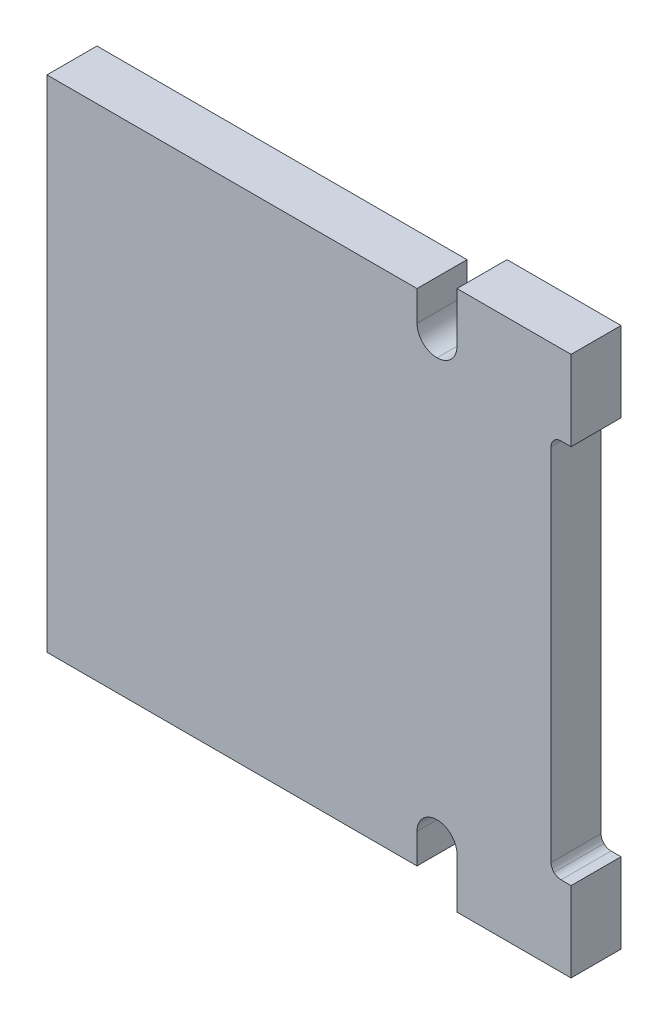
ISO-10303-21;
HEADER;
FILE_DESCRIPTION(('STEP AP214'),'2;1');
FILE_NAME('part.step','',(''),(''),'','','');
FILE_SCHEMA(('AUTOMOTIVE_DESIGN { 1 0 10303 214 1 1 1 1 }'));
ENDSEC;
DATA;
#1=APPLICATION_CONTEXT('core data for automotive mechanical design processes');
#2=APPLICATION_PROTOCOL_DEFINITION('international standard','automotive_design',2000,#1);
#3=PRODUCT_CONTEXT('',#1,'mechanical');
#4=PRODUCT('Part','Part','',(#3));
#5=PRODUCT_RELATED_PRODUCT_CATEGORY('part','',(#4));
#6=PRODUCT_DEFINITION_FORMATION('','',#4);
#7=PRODUCT_DEFINITION_CONTEXT('part definition',#1,'design');
#8=PRODUCT_DEFINITION('design','',#6,#7);
#9=PRODUCT_DEFINITION_SHAPE('','',#8);
#10=(LENGTH_UNIT() NAMED_UNIT(*) SI_UNIT(.MILLI.,.METRE.));
#11=(NAMED_UNIT(*) PLANE_ANGLE_UNIT() SI_UNIT($,.RADIAN.));
#12=(NAMED_UNIT(*) SI_UNIT($,.STERADIAN.) SOLID_ANGLE_UNIT());
#13=UNCERTAINTY_MEASURE_WITH_UNIT(LENGTH_MEASURE(1.E-05),#10,'distance_accuracy_value','');
#14=(GEOMETRIC_REPRESENTATION_CONTEXT(3) GLOBAL_UNCERTAINTY_ASSIGNED_CONTEXT((#13)) GLOBAL_UNIT_ASSIGNED_CONTEXT((#10,
#11,#12)) REPRESENTATION_CONTEXT('',''));
#15=CARTESIAN_POINT('',(0.,0.,0.));
#16=DIRECTION('',(0.,0.,1.));
#17=DIRECTION('',(1.,0.,0.));
#18=AXIS2_PLACEMENT_3D('',#15,#16,#17);
#19=CARTESIAN_POINT('',(2.5335472746525,0.,0.5));
#20=DIRECTION('',(0.,0.,1.));
#21=DIRECTION('',(1.,0.,0.));
#22=AXIS2_PLACEMENT_3D('',#19,#20,#21);
#23=PLANE('',#22);
#24=DIRECTION('',(0.,1.,0.));
#25=VECTOR('',#24,1.);
#26=CARTESIAN_POINT('',(-0.249999999999971,2.5,0.5));
#27=LINE('',#26,#25);
#28=CARTESIAN_POINT('',(-0.249999999999972,-2.50000000000011,0.5));
#29=VERTEX_POINT('',#28);
#30=CARTESIAN_POINT('',(-0.249999999999971,2.5,0.5));
#31=VERTEX_POINT('',#30);
#32=EDGE_CURVE('E356',#29,#31,#27,.T.);
#33=ORIENTED_EDGE('',*,*,#32,.F.);
#34=DIRECTION('',(-1.,0.,0.));
#35=VECTOR('',#34,1.);
#36=CARTESIAN_POINT('',(-0.249999999999972,-2.50000000000011,0.5));
#37=LINE('',#36,#35);
#38=CARTESIAN_POINT('',(3.45,-2.50000000000011,0.5));
#39=VERTEX_POINT('',#38);
#40=EDGE_CURVE('E11',#39,#29,#37,.T.);
#41=ORIENTED_EDGE('',*,*,#40,.F.);
#42=DIRECTION('',(0.,-1.,0.));
#43=VECTOR('',#42,1.);
#44=CARTESIAN_POINT('',(3.45000000000005,2.49999999999994,0.5));
#45=LINE('',#44,#43);
#46=CARTESIAN_POINT('',(3.45,-2.20000000000005,0.5));
#47=VERTEX_POINT('',#46);
#48=EDGE_CURVE('E400',#47,#39,#45,.T.);
#49=ORIENTED_EDGE('',*,*,#48,.F.);
#50=CARTESIAN_POINT('',(3.65,-2.20000000000005,0.5));
#51=DIRECTION('',(0.,0.,1.));
#52=DIRECTION('',(0.,1.,0.));
#53=AXIS2_PLACEMENT_3D('',#50,#51,#52);
#54=CIRCLE('',#53,0.199999999999989);
#55=CARTESIAN_POINT('',(3.65,-2.00000000000006,0.5));
#56=VERTEX_POINT('',#55);
#57=EDGE_CURVE('E533',#56,#47,#54,.T.);
#58=ORIENTED_EDGE('',*,*,#57,.F.);
#59=CARTESIAN_POINT('',(3.65,-2.20000000000005,0.5));
#60=DIRECTION('',(0.,0.,1.));
#61=DIRECTION('',(0.,1.,0.));
#62=AXIS2_PLACEMENT_3D('',#59,#60,#61);
#63=CIRCLE('',#62,0.199999999999989);
#64=CARTESIAN_POINT('',(3.85,-2.20000000000004,0.5));
#65=VERTEX_POINT('',#64);
#66=EDGE_CURVE('E46',#65,#56,#63,.T.);
#67=ORIENTED_EDGE('',*,*,#66,.F.);
#68=DIRECTION('',(0.,1.,0.));
#69=VECTOR('',#68,1.);
#70=CARTESIAN_POINT('',(3.85,0.999999999999772,0.5));
#71=LINE('',#70,#69);
#72=CARTESIAN_POINT('',(3.85,-2.7,0.5));
#73=VERTEX_POINT('',#72);
#74=EDGE_CURVE('E425',#73,#65,#71,.T.);
#75=ORIENTED_EDGE('',*,*,#74,.F.);
#76=DIRECTION('',(-1.,0.,0.));
#77=VECTOR('',#76,1.);
#78=CARTESIAN_POINT('',(3.85,-2.7,0.5));
#79=LINE('',#78,#77);
#80=CARTESIAN_POINT('',(4.99,-2.69999999999993,0.5));
#81=VERTEX_POINT('',#80);
#82=EDGE_CURVE('E420',#81,#73,#79,.T.);
#83=ORIENTED_EDGE('',*,*,#82,.F.);
#84=DIRECTION('',(0.,-1.,0.));
#85=VECTOR('',#84,1.);
#86=CARTESIAN_POINT('',(4.99,2.70000000000004,0.5));
#87=LINE('',#86,#85);
#88=CARTESIAN_POINT('',(4.99,-1.90000000000004,0.5));
#89=VERTEX_POINT('',#88);
#90=EDGE_CURVE('E412',#89,#81,#87,.T.);
#91=ORIENTED_EDGE('',*,*,#90,.F.);
#92=DIRECTION('',(1.,-2.84400785257291E-13,0.));
#93=VECTOR('',#92,1.);
#94=CARTESIAN_POINT('',(4.99,-1.90000000000004,0.5));
#95=LINE('',#94,#93);
#96=CARTESIAN_POINT('',(4.89,-1.9,0.5));
#97=VERTEX_POINT('',#96);
#98=EDGE_CURVE('E404',#97,#89,#95,.T.);
#99=ORIENTED_EDGE('',*,*,#98,.F.);
#100=CARTESIAN_POINT('',(4.89,-1.8,0.5));
#101=DIRECTION('',(0.,0.,1.));
#102=DIRECTION('',(-0.707106781186449,-0.707106781186646,0.));
#103=AXIS2_PLACEMENT_3D('',#100,#101,#102);
#104=CIRCLE('',#103,0.100000000000009);
#105=CARTESIAN_POINT('',(4.81928932188135,-1.87071067811867,0.5));
#106=VERTEX_POINT('',#105);
#107=EDGE_CURVE('E513',#106,#97,#104,.T.);
#108=ORIENTED_EDGE('',*,*,#107,.F.);
#109=CARTESIAN_POINT('',(4.89,-1.8,0.5));
#110=DIRECTION('',(0.,0.,1.));
#111=DIRECTION('',(-0.707106781186449,-0.707106781186646,0.));
#112=AXIS2_PLACEMENT_3D('',#109,#110,#111);
#113=CIRCLE('',#112,0.100000000000009);
#114=CARTESIAN_POINT('',(4.79,-1.8,0.5));
#115=VERTEX_POINT('',#114);
#116=EDGE_CURVE('E258',#115,#106,#113,.T.);
#117=ORIENTED_EDGE('',*,*,#116,.F.);
#118=DIRECTION('',(0.,-1.,0.));
#119=VECTOR('',#118,1.);
#120=CARTESIAN_POINT('',(4.79,-1.8,0.5));
#121=LINE('',#120,#119);
#122=CARTESIAN_POINT('',(4.79,1.79999999999995,0.5));
#123=VERTEX_POINT('',#122);
#124=EDGE_CURVE('E255',#123,#115,#121,.T.);
#125=ORIENTED_EDGE('',*,*,#124,.F.);
#126=CARTESIAN_POINT('',(4.89,1.79999999999995,0.5));
#127=DIRECTION('',(0.,0.,1.));
#128=DIRECTION('',(-0.707106781186547,0.707106781186549,0.));
#129=AXIS2_PLACEMENT_3D('',#126,#127,#128);
#130=CIRCLE('',#129,0.0999999999999942);
#131=CARTESIAN_POINT('',(4.81928932188135,1.8707106781186,0.5));
#132=VERTEX_POINT('',#131);
#133=EDGE_CURVE('E560',#132,#123,#130,.T.);
#134=ORIENTED_EDGE('',*,*,#133,.F.);
#135=CARTESIAN_POINT('',(4.89,1.79999999999995,0.5));
#136=DIRECTION('',(0.,0.,1.));
#137=DIRECTION('',(-0.707106781186547,0.707106781186549,0.));
#138=AXIS2_PLACEMENT_3D('',#135,#136,#137);
#139=CIRCLE('',#138,0.0999999999999942);
#140=CARTESIAN_POINT('',(4.89,1.89999999999995,0.5));
#141=VERTEX_POINT('',#140);
#142=EDGE_CURVE('E395',#141,#132,#139,.T.);
#143=ORIENTED_EDGE('',*,*,#142,.F.);
#144=DIRECTION('',(-1.,-2.84033403351144E-13,0.));
#145=VECTOR('',#144,1.);
#146=CARTESIAN_POINT('',(4.89,1.89999999999995,0.5));
#147=LINE('',#146,#145);
#148=CARTESIAN_POINT('',(4.99,1.9,0.5));
#149=VERTEX_POINT('',#148);
#150=EDGE_CURVE('E376',#149,#141,#147,.T.);
#151=ORIENTED_EDGE('',*,*,#150,.F.);
#152=DIRECTION('',(0.,-1.,0.));
#153=VECTOR('',#152,1.);
#154=CARTESIAN_POINT('',(4.99,1.9,0.5));
#155=LINE('',#154,#153);
#156=CARTESIAN_POINT('',(4.99,2.70000000000004,0.5));
#157=VERTEX_POINT('',#156);
#158=EDGE_CURVE('E388',#157,#149,#155,.T.);
#159=ORIENTED_EDGE('',*,*,#158,.F.);
#160=DIRECTION('',(1.,0.,0.));
#161=VECTOR('',#160,1.);
#162=CARTESIAN_POINT('',(4.99,2.70000000000004,0.5));
#163=LINE('',#162,#161);
#164=CARTESIAN_POINT('',(3.85000000000005,2.70000000000004,0.5));
#165=VERTEX_POINT('',#164);
#166=EDGE_CURVE('E347',#165,#157,#163,.T.);
#167=ORIENTED_EDGE('',*,*,#166,.F.);
#168=DIRECTION('',(0.,1.,0.));
#169=VECTOR('',#168,1.);
#170=CARTESIAN_POINT('',(3.85,0.999999999999772,0.5));
#171=LINE('',#170,#169);
#172=CARTESIAN_POINT('',(3.85,2.19999999999986,0.5));
#173=VERTEX_POINT('',#172);
#174=EDGE_CURVE('E329',#173,#165,#171,.T.);
#175=ORIENTED_EDGE('',*,*,#174,.F.);
#176=CARTESIAN_POINT('',(3.65,2.19999999999987,0.5));
#177=DIRECTION('',(0.,0.,1.));
#178=DIRECTION('',(0.,-1.,0.));
#179=AXIS2_PLACEMENT_3D('',#176,#177,#178);
#180=CIRCLE('',#179,0.200000000000003);
#181=CARTESIAN_POINT('',(3.65,1.99999999999987,0.5));
#182=VERTEX_POINT('',#181);
#183=EDGE_CURVE('E466',#182,#173,#180,.T.);
#184=ORIENTED_EDGE('',*,*,#183,.F.);
#185=CARTESIAN_POINT('',(3.65,2.19999999999987,0.5));
#186=DIRECTION('',(0.,0.,1.));
#187=DIRECTION('',(0.,-1.,0.));
#188=AXIS2_PLACEMENT_3D('',#185,#186,#187);
#189=CIRCLE('',#188,0.200000000000003);
#190=CARTESIAN_POINT('',(3.45,2.19999999999987,0.5));
#191=VERTEX_POINT('',#190);
#192=EDGE_CURVE('E334',#191,#182,#189,.T.);
#193=ORIENTED_EDGE('',*,*,#192,.F.);
#194=DIRECTION('',(0.,-1.,0.));
#195=VECTOR('',#194,1.);
#196=CARTESIAN_POINT('',(3.45,2.19999999999987,0.5));
#197=LINE('',#196,#195);
#198=CARTESIAN_POINT('',(3.45000000000005,2.49999999999994,0.5));
#199=VERTEX_POINT('',#198);
#200=EDGE_CURVE('E369',#199,#191,#197,.T.);
#201=ORIENTED_EDGE('',*,*,#200,.F.);
#202=DIRECTION('',(1.,0.,0.));
#203=VECTOR('',#202,1.);
#204=CARTESIAN_POINT('',(3.45000000000005,2.49999999999994,0.5));
#205=LINE('',#204,#203);
#206=EDGE_CURVE('E361',#31,#199,#205,.T.);
#207=ORIENTED_EDGE('',*,*,#206,.F.);
#208=EDGE_LOOP('',(#33,#41,#49,#58,#67,#75,#83,#91,#99,#108,#117,#125,#134,#143,#151,#159,#167,
#175,#184,#193,#201,#207));
#209=FACE_BOUND('',#208,.T.);
#210=ADVANCED_FACE('F17',(#209),#23,.T.);
#211=CARTESIAN_POINT('',(3.45,-2.50000000000011,0.));
#212=DIRECTION('',(0.,-1.,0.));
#213=DIRECTION('',(-1.,0.,0.));
#214=AXIS2_PLACEMENT_3D('',#211,#212,#213);
#215=PLANE('',#214);
#216=ORIENTED_EDGE('',*,*,#40,.T.);
#217=DIRECTION('',(0.,0.,1.));
#218=VECTOR('',#217,1.);
#219=CARTESIAN_POINT('',(-0.249999999999972,-2.50000000000011,0.));
#220=LINE('',#219,#218);
#221=CARTESIAN_POINT('',(-0.249999999999972,-2.50000000000011,0.));
#222=VERTEX_POINT('',#221);
#223=EDGE_CURVE('E352',#222,#29,#220,.T.);
#224=ORIENTED_EDGE('',*,*,#223,.F.);
#225=DIRECTION('',(1.,0.,0.));
#226=VECTOR('',#225,1.);
#227=CARTESIAN_POINT('',(-0.249999999999972,-2.50000000000011,0.));
#228=LINE('',#227,#226);
#229=CARTESIAN_POINT('',(3.45,-2.50000000000011,0.));
#230=VERTEX_POINT('',#229);
#231=EDGE_CURVE('E312',#222,#230,#228,.T.);
#232=ORIENTED_EDGE('',*,*,#231,.T.);
#233=DIRECTION('',(0.,0.,1.));
#234=VECTOR('',#233,1.);
#235=CARTESIAN_POINT('',(3.44999999999958,-2.50000000000011,0.));
#236=LINE('',#235,#234);
#237=EDGE_CURVE('E25',#230,#39,#236,.T.);
#238=ORIENTED_EDGE('',*,*,#237,.T.);
#239=EDGE_LOOP('',(#216,#224,#232,#238));
#240=FACE_BOUND('',#239,.T.);
#241=ADVANCED_FACE('F611',(#240),#215,.T.);
#242=CARTESIAN_POINT('',(3.45000000000005,2.49999999999994,0.));
#243=DIRECTION('',(1.,0.,0.));
#244=DIRECTION('',(0.,-1.,0.));
#245=AXIS2_PLACEMENT_3D('',#242,#243,#244);
#246=PLANE('',#245);
#247=ORIENTED_EDGE('',*,*,#48,.T.);
#248=ORIENTED_EDGE('',*,*,#237,.F.);
#249=DIRECTION('',(0.,1.,0.));
#250=VECTOR('',#249,1.);
#251=CARTESIAN_POINT('',(3.45000000000005,2.49999999999994,0.));
#252=LINE('',#251,#250);
#253=CARTESIAN_POINT('',(3.45,-2.20000000000005,0.));
#254=VERTEX_POINT('',#253);
#255=EDGE_CURVE('E306',#230,#254,#252,.T.);
#256=ORIENTED_EDGE('',*,*,#255,.T.);
#257=DIRECTION('',(0.,0.,1.));
#258=VECTOR('',#257,1.);
#259=CARTESIAN_POINT('',(3.44999999999981,-2.20000000000003,0.));
#260=LINE('',#259,#258);
#261=EDGE_CURVE('E526',#254,#47,#260,.T.);
#262=ORIENTED_EDGE('',*,*,#261,.T.);
#263=EDGE_LOOP('',(#247,#248,#256,#262));
#264=FACE_BOUND('',#263,.T.);
#265=ADVANCED_FACE('F540',(#264),#246,.T.);
#266=CARTESIAN_POINT('',(3.65,-2.20000000000005,0.));
#267=DIRECTION('',(0.,0.,1.));
#268=DIRECTION('',(0.,1.,0.));
#269=AXIS2_PLACEMENT_3D('',#266,#267,#268);
#270=CYLINDRICAL_SURFACE('',#269,0.199999999999989);
#271=DIRECTION('',(0.,0.,1.));
#272=VECTOR('',#271,1.);
#273=CARTESIAN_POINT('',(3.65,-2.00000000000006,0.));
#274=LINE('',#273,#272);
#275=CARTESIAN_POINT('',(3.65,-2.00000000000006,0.));
#276=VERTEX_POINT('',#275);
#277=EDGE_CURVE('E552',#276,#56,#274,.T.);
#278=ORIENTED_EDGE('',*,*,#277,.F.);
#279=CARTESIAN_POINT('',(3.65,-2.20000000000005,0.));
#280=DIRECTION('',(0.,0.,-1.));
#281=DIRECTION('',(0.,1.,0.));
#282=AXIS2_PLACEMENT_3D('',#279,#280,#281);
#283=CIRCLE('',#282,0.199999999999989);
#284=CARTESIAN_POINT('',(3.85,-2.20000000000004,0.));
#285=VERTEX_POINT('',#284);
#286=EDGE_CURVE('E301',#276,#285,#283,.T.);
#287=ORIENTED_EDGE('',*,*,#286,.T.);
#288=DIRECTION('',(0.,0.,1.));
#289=VECTOR('',#288,1.);
#290=CARTESIAN_POINT('',(3.85,-2.20000000000005,0.));
#291=LINE('',#290,#289);
#292=EDGE_CURVE('E401',#285,#65,#291,.T.);
#293=ORIENTED_EDGE('',*,*,#292,.T.);
#294=ORIENTED_EDGE('',*,*,#66,.T.);
#295=EDGE_LOOP('',(#278,#287,#293,#294));
#296=FACE_BOUND('',#295,.T.);
#297=ADVANCED_FACE('F996',(#296),#270,.F.);
#298=CARTESIAN_POINT('',(3.85,0.999999999999772,0.));
#299=DIRECTION('',(1.,0.,0.));
#300=DIRECTION('',(0.,-1.,0.));
#301=AXIS2_PLACEMENT_3D('',#298,#299,#300);
#302=PLANE('',#301);
#303=ORIENTED_EDGE('',*,*,#74,.T.);
#304=ORIENTED_EDGE('',*,*,#292,.F.);
#305=DIRECTION('',(0.,-1.,0.));
#306=VECTOR('',#305,1.);
#307=CARTESIAN_POINT('',(3.85,0.999999999999772,0.));
#308=LINE('',#307,#306);
#309=CARTESIAN_POINT('',(3.85,-2.7,0.));
#310=VERTEX_POINT('',#309);
#311=EDGE_CURVE('E297',#285,#310,#308,.T.);
#312=ORIENTED_EDGE('',*,*,#311,.T.);
#313=DIRECTION('',(0.,0.,1.));
#314=VECTOR('',#313,1.);
#315=CARTESIAN_POINT('',(3.85,-2.7,0.));
#316=LINE('',#315,#314);
#317=EDGE_CURVE('E421',#310,#73,#316,.T.);
#318=ORIENTED_EDGE('',*,*,#317,.T.);
#319=EDGE_LOOP('',(#303,#304,#312,#318));
#320=FACE_BOUND('',#319,.T.);
#321=ADVANCED_FACE('F994',(#320),#302,.F.);
#322=CARTESIAN_POINT('',(4.99,-2.69999999999993,0.));
#323=DIRECTION('',(0.,-1.,0.));
#324=DIRECTION('',(0.,0.,-1.));
#325=AXIS2_PLACEMENT_3D('',#322,#323,#324);
#326=PLANE('',#325);
#327=ORIENTED_EDGE('',*,*,#82,.T.);
#328=ORIENTED_EDGE('',*,*,#317,.F.);
#329=DIRECTION('',(1.,0.,0.));
#330=VECTOR('',#329,1.);
#331=CARTESIAN_POINT('',(3.85,-2.7,0.));
#332=LINE('',#331,#330);
#333=CARTESIAN_POINT('',(4.99,-2.69999999999993,0.));
#334=VERTEX_POINT('',#333);
#335=EDGE_CURVE('E302',#310,#334,#332,.T.);
#336=ORIENTED_EDGE('',*,*,#335,.T.);
#337=DIRECTION('',(0.,0.,1.));
#338=VECTOR('',#337,1.);
#339=CARTESIAN_POINT('',(4.99,-2.69999999999993,0.));
#340=LINE('',#339,#338);
#341=EDGE_CURVE('E416',#334,#81,#340,.T.);
#342=ORIENTED_EDGE('',*,*,#341,.T.);
#343=EDGE_LOOP('',(#327,#328,#336,#342));
#344=FACE_BOUND('',#343,.T.);
#345=ADVANCED_FACE('F989',(#344),#326,.T.);
#346=CARTESIAN_POINT('',(4.99,2.70000000000004,0.));
#347=DIRECTION('',(1.,0.,0.));
#348=DIRECTION('',(0.,-1.,0.));
#349=AXIS2_PLACEMENT_3D('',#346,#347,#348);
#350=PLANE('',#349);
#351=ORIENTED_EDGE('',*,*,#90,.T.);
#352=ORIENTED_EDGE('',*,*,#341,.F.);
#353=DIRECTION('',(0.,1.,0.));
#354=VECTOR('',#353,1.);
#355=CARTESIAN_POINT('',(4.99,2.70000000000004,0.));
#356=LINE('',#355,#354);
#357=CARTESIAN_POINT('',(4.99,-1.90000000000004,0.));
#358=VERTEX_POINT('',#357);
#359=EDGE_CURVE('E290',#334,#358,#356,.T.);
#360=ORIENTED_EDGE('',*,*,#359,.T.);
#361=DIRECTION('',(0.,0.,1.));
#362=VECTOR('',#361,1.);
#363=CARTESIAN_POINT('',(4.99,-1.90000000000004,0.));
#364=LINE('',#363,#362);
#365=EDGE_CURVE('E408',#358,#89,#364,.T.);
#366=ORIENTED_EDGE('',*,*,#365,.T.);
#367=EDGE_LOOP('',(#351,#352,#360,#366));
#368=FACE_BOUND('',#367,.T.);
#369=ADVANCED_FACE('F992',(#368),#350,.T.);
#370=CARTESIAN_POINT('',(4.89,-1.9,0.));
#371=DIRECTION('',(2.84400785257291E-13,1.,0.));
#372=DIRECTION('',(1.,-2.84400785257291E-13,0.));
#373=AXIS2_PLACEMENT_3D('',#370,#371,#372);
#374=PLANE('',#373);
#375=ORIENTED_EDGE('',*,*,#98,.T.);
#376=ORIENTED_EDGE('',*,*,#365,.F.);
#377=DIRECTION('',(-1.,2.84400785257291E-13,0.));
#378=VECTOR('',#377,1.);
#379=CARTESIAN_POINT('',(4.99,-1.90000000000004,0.));
#380=LINE('',#379,#378);
#381=CARTESIAN_POINT('',(4.89,-1.9,0.));
#382=VERTEX_POINT('',#381);
#383=EDGE_CURVE('E269',#358,#382,#380,.T.);
#384=ORIENTED_EDGE('',*,*,#383,.T.);
#385=DIRECTION('',(0.,0.,1.));
#386=VECTOR('',#385,1.);
#387=CARTESIAN_POINT('',(4.89,-1.9,0.));
#388=LINE('',#387,#386);
#389=EDGE_CURVE('E451',#382,#97,#388,.T.);
#390=ORIENTED_EDGE('',*,*,#389,.T.);
#391=EDGE_LOOP('',(#375,#376,#384,#390));
#392=FACE_BOUND('',#391,.T.);
#393=ADVANCED_FACE('F1054',(#392),#374,.T.);
#394=CARTESIAN_POINT('',(4.89,-1.8,0.));
#395=DIRECTION('',(0.,0.,1.));
#396=DIRECTION('',(-0.707106781186449,-0.707106781186646,0.));
#397=AXIS2_PLACEMENT_3D('',#394,#395,#396);
#398=CYLINDRICAL_SURFACE('',#397,0.100000000000009);
#399=DIRECTION('',(0.,0.,1.));
#400=VECTOR('',#399,1.);
#401=CARTESIAN_POINT('',(4.81928932188135,-1.87071067811867,0.));
#402=LINE('',#401,#400);
#403=CARTESIAN_POINT('',(4.81928932188135,-1.87071067811867,0.));
#404=VERTEX_POINT('',#403);
#405=EDGE_CURVE('E264',#404,#106,#402,.T.);
#406=ORIENTED_EDGE('',*,*,#405,.F.);
#407=CARTESIAN_POINT('',(4.89,-1.8,0.));
#408=DIRECTION('',(0.,0.,-1.));
#409=DIRECTION('',(-0.707106781186449,-0.707106781186646,0.));
#410=AXIS2_PLACEMENT_3D('',#407,#408,#409);
#411=CIRCLE('',#410,0.100000000000009);
#412=CARTESIAN_POINT('',(4.79,-1.8,0.));
#413=VERTEX_POINT('',#412);
#414=EDGE_CURVE('E261',#404,#413,#411,.T.);
#415=ORIENTED_EDGE('',*,*,#414,.T.);
#416=DIRECTION('',(0.,0.,1.));
#417=VECTOR('',#416,1.);
#418=CARTESIAN_POINT('',(4.79,-1.8,0.));
#419=LINE('',#418,#417);
#420=EDGE_CURVE('E248',#413,#115,#419,.T.);
#421=ORIENTED_EDGE('',*,*,#420,.T.);
#422=ORIENTED_EDGE('',*,*,#116,.T.);
#423=EDGE_LOOP('',(#406,#415,#421,#422));
#424=FACE_BOUND('',#423,.T.);
#425=ADVANCED_FACE('F262',(#424),#398,.F.);
#426=CARTESIAN_POINT('',(4.79,1.79999999999995,0.));
#427=DIRECTION('',(1.,0.,0.));
#428=DIRECTION('',(0.,-1.,0.));
#429=AXIS2_PLACEMENT_3D('',#426,#427,#428);
#430=PLANE('',#429);
#431=ORIENTED_EDGE('',*,*,#124,.T.);
#432=ORIENTED_EDGE('',*,*,#420,.F.);
#433=DIRECTION('',(0.,1.,0.));
#434=VECTOR('',#433,1.);
#435=CARTESIAN_POINT('',(4.79,-1.8,0.));
#436=LINE('',#435,#434);
#437=CARTESIAN_POINT('',(4.79,1.79999999999995,0.));
#438=VERTEX_POINT('',#437);
#439=EDGE_CURVE('E253',#413,#438,#436,.T.);
#440=ORIENTED_EDGE('',*,*,#439,.T.);
#441=DIRECTION('',(0.,0.,1.));
#442=VECTOR('',#441,1.);
#443=CARTESIAN_POINT('',(4.79,1.79999999999995,0.));
#444=LINE('',#443,#442);
#445=EDGE_CURVE('E459',#438,#123,#444,.T.);
#446=ORIENTED_EDGE('',*,*,#445,.T.);
#447=EDGE_LOOP('',(#431,#432,#440,#446));
#448=FACE_BOUND('',#447,.T.);
#449=ADVANCED_FACE('F250',(#448),#430,.T.);
#450=CARTESIAN_POINT('',(4.89,1.79999999999995,0.));
#451=DIRECTION('',(0.,0.,1.));
#452=DIRECTION('',(-0.707106781186547,0.707106781186549,0.));
#453=AXIS2_PLACEMENT_3D('',#450,#451,#452);
#454=CYLINDRICAL_SURFACE('',#453,0.0999999999999942);
#455=DIRECTION('',(0.,0.,1.));
#456=VECTOR('',#455,1.);
#457=CARTESIAN_POINT('',(4.81928932188135,1.8707106781186,0.));
#458=LINE('',#457,#456);
#459=CARTESIAN_POINT('',(4.81928932188135,1.8707106781186,0.));
#460=VERTEX_POINT('',#459);
#461=EDGE_CURVE('E444',#460,#132,#458,.T.);
#462=ORIENTED_EDGE('',*,*,#461,.F.);
#463=CARTESIAN_POINT('',(4.89,1.79999999999995,0.));
#464=DIRECTION('',(0.,0.,-1.));
#465=DIRECTION('',(-0.707106781186547,0.707106781186549,0.));
#466=AXIS2_PLACEMENT_3D('',#463,#464,#465);
#467=CIRCLE('',#466,0.0999999999999942);
#468=CARTESIAN_POINT('',(4.89,1.89999999999995,0.));
#469=VERTEX_POINT('',#468);
#470=EDGE_CURVE('E277',#460,#469,#467,.T.);
#471=ORIENTED_EDGE('',*,*,#470,.T.);
#472=DIRECTION('',(0.,0.,1.));
#473=VECTOR('',#472,1.);
#474=CARTESIAN_POINT('',(4.89,1.89999999999995,0.));
#475=LINE('',#474,#473);
#476=EDGE_CURVE('E380',#469,#141,#475,.T.);
#477=ORIENTED_EDGE('',*,*,#476,.T.);
#478=ORIENTED_EDGE('',*,*,#142,.T.);
#479=EDGE_LOOP('',(#462,#471,#477,#478));
#480=FACE_BOUND('',#479,.T.);
#481=ADVANCED_FACE('F580',(#480),#454,.F.);
#482=CARTESIAN_POINT('',(4.99,1.9,0.));
#483=DIRECTION('',(2.84033403351144E-13,-1.,0.));
#484=DIRECTION('',(0.,0.,-1.));
#485=AXIS2_PLACEMENT_3D('',#482,#483,#484);
#486=PLANE('',#485);
#487=ORIENTED_EDGE('',*,*,#150,.T.);
#488=ORIENTED_EDGE('',*,*,#476,.F.);
#489=DIRECTION('',(1.,2.84033403351144E-13,0.));
#490=VECTOR('',#489,1.);
#491=CARTESIAN_POINT('',(4.89,1.89999999999995,0.));
#492=LINE('',#491,#490);
#493=CARTESIAN_POINT('',(4.99,1.9,0.));
#494=VERTEX_POINT('',#493);
#495=EDGE_CURVE('E284',#469,#494,#492,.T.);
#496=ORIENTED_EDGE('',*,*,#495,.T.);
#497=DIRECTION('',(0.,0.,1.));
#498=VECTOR('',#497,1.);
#499=CARTESIAN_POINT('',(4.99,1.9,0.));
#500=LINE('',#499,#498);
#501=EDGE_CURVE('E381',#494,#149,#500,.T.);
#502=ORIENTED_EDGE('',*,*,#501,.T.);
#503=EDGE_LOOP('',(#487,#488,#496,#502));
#504=FACE_BOUND('',#503,.T.);
#505=ADVANCED_FACE('F584',(#504),#486,.T.);
#506=CARTESIAN_POINT('',(4.99,2.70000000000004,0.));
#507=DIRECTION('',(1.,0.,0.));
#508=DIRECTION('',(0.,-1.,0.));
#509=AXIS2_PLACEMENT_3D('',#506,#507,#508);
#510=PLANE('',#509);
#511=ORIENTED_EDGE('',*,*,#158,.T.);
#512=ORIENTED_EDGE('',*,*,#501,.F.);
#513=DIRECTION('',(0.,1.,0.));
#514=VECTOR('',#513,1.);
#515=CARTESIAN_POINT('',(4.99,1.9,0.));
#516=LINE('',#515,#514);
#517=CARTESIAN_POINT('',(4.99,2.70000000000004,0.));
#518=VERTEX_POINT('',#517);
#519=EDGE_CURVE('E505',#494,#518,#516,.T.);
#520=ORIENTED_EDGE('',*,*,#519,.T.);
#521=DIRECTION('',(0.,0.,1.));
#522=VECTOR('',#521,1.);
#523=CARTESIAN_POINT('',(4.99,2.70000000000004,0.));
#524=LINE('',#523,#522);
#525=EDGE_CURVE('E351',#518,#157,#524,.T.);
#526=ORIENTED_EDGE('',*,*,#525,.T.);
#527=EDGE_LOOP('',(#511,#512,#520,#526));
#528=FACE_BOUND('',#527,.T.);
#529=ADVANCED_FACE('F587',(#528),#510,.T.);
#530=CARTESIAN_POINT('',(3.85000000000005,2.70000000000004,0.));
#531=DIRECTION('',(0.,1.,0.));
#532=DIRECTION('',(1.,0.,0.));
#533=AXIS2_PLACEMENT_3D('',#530,#531,#532);
#534=PLANE('',#533);
#535=ORIENTED_EDGE('',*,*,#166,.T.);
#536=ORIENTED_EDGE('',*,*,#525,.F.);
#537=DIRECTION('',(-1.,0.,0.));
#538=VECTOR('',#537,1.);
#539=CARTESIAN_POINT('',(4.99,2.70000000000004,0.));
#540=LINE('',#539,#538);
#541=CARTESIAN_POINT('',(3.85000000000005,2.70000000000004,0.));
#542=VERTEX_POINT('',#541);
#543=EDGE_CURVE('E498',#518,#542,#540,.T.);
#544=ORIENTED_EDGE('',*,*,#543,.T.);
#545=DIRECTION('',(0.,0.,1.));
#546=VECTOR('',#545,1.);
#547=CARTESIAN_POINT('',(3.85,2.70000000000004,0.));
#548=LINE('',#547,#546);
#549=EDGE_CURVE('E333',#542,#165,#548,.T.);
#550=ORIENTED_EDGE('',*,*,#549,.T.);
#551=EDGE_LOOP('',(#535,#536,#544,#550));
#552=FACE_BOUND('',#551,.T.);
#553=ADVANCED_FACE('F590',(#552),#534,.T.);
#554=CARTESIAN_POINT('',(3.85,0.999999999999772,0.));
#555=DIRECTION('',(1.,0.,0.));
#556=DIRECTION('',(0.,-1.,0.));
#557=AXIS2_PLACEMENT_3D('',#554,#555,#556);
#558=PLANE('',#557);
#559=ORIENTED_EDGE('',*,*,#174,.T.);
#560=ORIENTED_EDGE('',*,*,#549,.F.);
#561=DIRECTION('',(0.,-1.,0.));
#562=VECTOR('',#561,1.);
#563=CARTESIAN_POINT('',(3.85,0.999999999999772,0.));
#564=LINE('',#563,#562);
#565=CARTESIAN_POINT('',(3.85,2.19999999999986,0.));
#566=VERTEX_POINT('',#565);
#567=EDGE_CURVE('E495',#542,#566,#564,.T.);
#568=ORIENTED_EDGE('',*,*,#567,.T.);
#569=DIRECTION('',(0.,0.,1.));
#570=VECTOR('',#569,1.);
#571=CARTESIAN_POINT('',(3.85,2.19999999999987,0.));
#572=LINE('',#571,#570);
#573=EDGE_CURVE('E470',#566,#173,#572,.T.);
#574=ORIENTED_EDGE('',*,*,#573,.T.);
#575=EDGE_LOOP('',(#559,#560,#568,#574));
#576=FACE_BOUND('',#575,.T.);
#577=ADVANCED_FACE('F594',(#576),#558,.F.);
#578=CARTESIAN_POINT('',(3.65,2.19999999999987,0.));
#579=DIRECTION('',(0.,0.,1.));
#580=DIRECTION('',(0.,-1.,0.));
#581=AXIS2_PLACEMENT_3D('',#578,#579,#580);
#582=CYLINDRICAL_SURFACE('',#581,0.200000000000003);
#583=DIRECTION('',(0.,0.,1.));
#584=VECTOR('',#583,1.);
#585=CARTESIAN_POINT('',(3.65,1.99999999999987,0.));
#586=LINE('',#585,#584);
#587=CARTESIAN_POINT('',(3.65,1.99999999999987,0.));
#588=VERTEX_POINT('',#587);
#589=EDGE_CURVE('E458',#588,#182,#586,.T.);
#590=ORIENTED_EDGE('',*,*,#589,.F.);
#591=CARTESIAN_POINT('',(3.65,2.19999999999987,0.));
#592=DIRECTION('',(0.,0.,-1.));
#593=DIRECTION('',(0.,-1.,0.));
#594=AXIS2_PLACEMENT_3D('',#591,#592,#593);
#595=CIRCLE('',#594,0.200000000000003);
#596=CARTESIAN_POINT('',(3.45,2.19999999999987,0.));
#597=VERTEX_POINT('',#596);
#598=EDGE_CURVE('E491',#588,#597,#595,.T.);
#599=ORIENTED_EDGE('',*,*,#598,.T.);
#600=DIRECTION('',(0.,0.,1.));
#601=VECTOR('',#600,1.);
#602=CARTESIAN_POINT('',(3.45,2.19999999999987,0.));
#603=LINE('',#602,#601);
#604=EDGE_CURVE('E370',#597,#191,#603,.T.);
#605=ORIENTED_EDGE('',*,*,#604,.T.);
#606=ORIENTED_EDGE('',*,*,#192,.T.);
#607=EDGE_LOOP('',(#590,#599,#605,#606));
#608=FACE_BOUND('',#607,.T.);
#609=ADVANCED_FACE('F601',(#608),#582,.F.);
#610=CARTESIAN_POINT('',(3.45000000000005,2.49999999999994,0.));
#611=DIRECTION('',(1.,0.,0.));
#612=DIRECTION('',(0.,-1.,0.));
#613=AXIS2_PLACEMENT_3D('',#610,#611,#612);
#614=PLANE('',#613);
#615=ORIENTED_EDGE('',*,*,#200,.T.);
#616=ORIENTED_EDGE('',*,*,#604,.F.);
#617=DIRECTION('',(0.,1.,0.));
#618=VECTOR('',#617,1.);
#619=CARTESIAN_POINT('',(3.45,2.19999999999987,0.));
#620=LINE('',#619,#618);
#621=CARTESIAN_POINT('',(3.45000000000005,2.49999999999994,0.));
#622=VERTEX_POINT('',#621);
#623=EDGE_CURVE('E487',#597,#622,#620,.T.);
#624=ORIENTED_EDGE('',*,*,#623,.T.);
#625=DIRECTION('',(0.,0.,1.));
#626=VECTOR('',#625,1.);
#627=CARTESIAN_POINT('',(3.45000000000005,2.49999999999994,0.));
#628=LINE('',#627,#626);
#629=EDGE_CURVE('E365',#622,#199,#628,.T.);
#630=ORIENTED_EDGE('',*,*,#629,.T.);
#631=EDGE_LOOP('',(#615,#616,#624,#630));
#632=FACE_BOUND('',#631,.T.);
#633=ADVANCED_FACE('F604',(#632),#614,.T.);
#634=CARTESIAN_POINT('',(-0.249999999999971,2.5,0.));
#635=DIRECTION('',(0.,1.,0.));
#636=DIRECTION('',(1.,0.,0.));
#637=AXIS2_PLACEMENT_3D('',#634,#635,#636);
#638=PLANE('',#637);
#639=ORIENTED_EDGE('',*,*,#206,.T.);
#640=ORIENTED_EDGE('',*,*,#629,.F.);
#641=DIRECTION('',(-1.,0.,0.));
#642=VECTOR('',#641,1.);
#643=CARTESIAN_POINT('',(3.45000000000005,2.49999999999994,0.));
#644=LINE('',#643,#642);
#645=CARTESIAN_POINT('',(-0.249999999999971,2.5,0.));
#646=VERTEX_POINT('',#645);
#647=EDGE_CURVE('E483',#622,#646,#644,.T.);
#648=ORIENTED_EDGE('',*,*,#647,.T.);
#649=DIRECTION('',(0.,0.,1.));
#650=VECTOR('',#649,1.);
#651=CARTESIAN_POINT('',(-0.249999999999971,2.5,0.));
#652=LINE('',#651,#650);
#653=EDGE_CURVE('E357',#646,#31,#652,.T.);
#654=ORIENTED_EDGE('',*,*,#653,.T.);
#655=EDGE_LOOP('',(#639,#640,#648,#654));
#656=FACE_BOUND('',#655,.T.);
#657=ADVANCED_FACE('F607',(#656),#638,.T.);
#658=CARTESIAN_POINT('',(-0.249999999999972,-2.50000000000011,0.));
#659=DIRECTION('',(-1.,0.,0.));
#660=DIRECTION('',(0.,0.,1.));
#661=AXIS2_PLACEMENT_3D('',#658,#659,#660);
#662=PLANE('',#661);
#663=DIRECTION('',(0.,0.,1.));
#664=VECTOR('',#663,1.);
#665=CARTESIAN_POINT('',(-0.249999999999972,0.499999999999943,0.));
#666=LINE('',#665,#664);
#667=CARTESIAN_POINT('',(-0.249999999999972,0.499999999999943,0.));
#668=VERTEX_POINT('',#667);
#669=CARTESIAN_POINT('',(-0.249999999999972,0.499999999999943,0.03));
#670=VERTEX_POINT('',#669);
#671=EDGE_CURVE('E291',#668,#670,#666,.T.);
#672=ORIENTED_EDGE('',*,*,#671,.T.);
#673=DIRECTION('',(0.,-1.,0.));
#674=VECTOR('',#673,1.);
#675=CARTESIAN_POINT('',(-0.249999999999972,-1.25000000000009,0.03));
#676=LINE('',#675,#674);
#677=CARTESIAN_POINT('',(-0.249999999999972,-0.500000000000057,0.03));
#678=VERTEX_POINT('',#677);
#679=EDGE_CURVE('E345',#670,#678,#676,.T.);
#680=ORIENTED_EDGE('',*,*,#679,.T.);
#681=DIRECTION('',(0.,0.,-1.));
#682=VECTOR('',#681,1.);
#683=CARTESIAN_POINT('',(-0.249999999999972,-0.500000000000057,0.));
#684=LINE('',#683,#682);
#685=CARTESIAN_POINT('',(-0.249999999999972,-0.500000000000057,0.));
#686=VERTEX_POINT('',#685);
#687=EDGE_CURVE('E328',#678,#686,#684,.T.);
#688=ORIENTED_EDGE('',*,*,#687,.T.);
#689=DIRECTION('',(0.,-1.,0.));
#690=VECTOR('',#689,1.);
#691=CARTESIAN_POINT('',(-0.249999999999971,2.5,0.));
#692=LINE('',#691,#690);
#693=EDGE_CURVE('E307',#686,#222,#692,.T.);
#694=ORIENTED_EDGE('',*,*,#693,.T.);
#695=ORIENTED_EDGE('',*,*,#223,.T.);
#696=ORIENTED_EDGE('',*,*,#32,.T.);
#697=ORIENTED_EDGE('',*,*,#653,.F.);
#698=DIRECTION('',(0.,-1.,0.));
#699=VECTOR('',#698,1.);
#700=CARTESIAN_POINT('',(-0.249999999999971,2.5,0.));
#701=LINE('',#700,#699);
#702=EDGE_CURVE('E479',#646,#668,#701,.T.);
#703=ORIENTED_EDGE('',*,*,#702,.T.);
#704=EDGE_LOOP('',(#672,#680,#688,#694,#695,#696,#697,#703));
#705=FACE_BOUND('',#704,.T.);
#706=ADVANCED_FACE('F609',(#705),#662,.T.);
#707=CARTESIAN_POINT('',(-0.0999999999999091,0.,0.03));
#708=DIRECTION('',(0.,0.,1.));
#709=DIRECTION('',(1.,0.,0.));
#710=AXIS2_PLACEMENT_3D('',#707,#708,#709);
#711=PLANE('',#710);
#712=DIRECTION('',(-1.,0.,0.));
#713=VECTOR('',#712,1.);
#714=CARTESIAN_POINT('',(0.0500000000001534,-0.500000000000057,0.03));
#715=LINE('',#714,#713);
#716=CARTESIAN_POINT('',(0.0500000000001534,-0.500000000000057,0.03));
#717=VERTEX_POINT('',#716);
#718=EDGE_CURVE('E320',#717,#678,#715,.T.);
#719=ORIENTED_EDGE('',*,*,#718,.T.);
#720=ORIENTED_EDGE('',*,*,#679,.F.);
#721=DIRECTION('',(1.,0.,0.));
#722=VECTOR('',#721,1.);
#723=CARTESIAN_POINT('',(-0.249999999999972,0.499999999999943,0.03));
#724=LINE('',#723,#722);
#725=CARTESIAN_POINT('',(0.0500000000001536,0.499999999999943,0.03));
#726=VERTEX_POINT('',#725);
#727=EDGE_CURVE('E296',#670,#726,#724,.T.);
#728=ORIENTED_EDGE('',*,*,#727,.T.);
#729=DIRECTION('',(0.,-1.,0.));
#730=VECTOR('',#729,1.);
#731=CARTESIAN_POINT('',(0.0500000000001536,0.499999999999943,0.03));
#732=LINE('',#731,#730);
#733=EDGE_CURVE('E343',#726,#717,#732,.T.);
#734=ORIENTED_EDGE('',*,*,#733,.T.);
#735=EDGE_LOOP('',(#719,#720,#728,#734));
#736=FACE_BOUND('',#735,.T.);
#737=ADVANCED_FACE('F625',(#736),#711,.F.);
#738=CARTESIAN_POINT('',(0.0500000000001536,0.499999999999943,0.));
#739=DIRECTION('',(1.,0.,0.));
#740=DIRECTION('',(0.,-1.,0.));
#741=AXIS2_PLACEMENT_3D('',#738,#739,#740);
#742=PLANE('',#741);
#743=ORIENTED_EDGE('',*,*,#733,.F.);
#744=DIRECTION('',(0.,0.,1.));
#745=VECTOR('',#744,1.);
#746=CARTESIAN_POINT('',(0.0500000000001536,0.499999999999943,0.));
#747=LINE('',#746,#745);
#748=CARTESIAN_POINT('',(0.0500000000001536,0.499999999999943,0.));
#749=VERTEX_POINT('',#748);
#750=EDGE_CURVE('E295',#749,#726,#747,.T.);
#751=ORIENTED_EDGE('',*,*,#750,.F.);
#752=DIRECTION('',(0.,1.,0.));
#753=VECTOR('',#752,1.);
#754=CARTESIAN_POINT('',(0.0500000000001535,0.249999999999971,0.));
#755=LINE('',#754,#753);
#756=CARTESIAN_POINT('',(0.0500000000001534,-0.500000000000057,0.));
#757=VERTEX_POINT('',#756);
#758=EDGE_CURVE('E316',#757,#749,#755,.T.);
#759=ORIENTED_EDGE('',*,*,#758,.F.);
#760=DIRECTION('',(0.,0.,1.));
#761=VECTOR('',#760,1.);
#762=CARTESIAN_POINT('',(0.0500000000001534,-0.500000000000057,0.));
#763=LINE('',#762,#761);
#764=EDGE_CURVE('E324',#757,#717,#763,.T.);
#765=ORIENTED_EDGE('',*,*,#764,.T.);
#766=EDGE_LOOP('',(#743,#751,#759,#765));
#767=FACE_BOUND('',#766,.T.);
#768=ADVANCED_FACE('F620',(#767),#742,.F.);
#769=CARTESIAN_POINT('',(-0.249999999999972,0.499999999999943,0.));
#770=DIRECTION('',(0.,1.,0.));
#771=DIRECTION('',(1.,0.,0.));
#772=AXIS2_PLACEMENT_3D('',#769,#770,#771);
#773=PLANE('',#772);
#774=ORIENTED_EDGE('',*,*,#727,.F.);
#775=ORIENTED_EDGE('',*,*,#671,.F.);
#776=DIRECTION('',(-1.,0.,0.));
#777=VECTOR('',#776,1.);
#778=CARTESIAN_POINT('',(1.14177363732626,0.499999999999943,0.));
#779=LINE('',#778,#777);
#780=EDGE_CURVE('E474',#749,#668,#779,.T.);
#781=ORIENTED_EDGE('',*,*,#780,.F.);
#782=ORIENTED_EDGE('',*,*,#750,.T.);
#783=EDGE_LOOP('',(#774,#775,#781,#782));
#784=FACE_BOUND('',#783,.T.);
#785=ADVANCED_FACE('F623',(#784),#773,.F.);
#786=CARTESIAN_POINT('',(0.0500000000001534,-0.500000000000057,0.));
#787=DIRECTION('',(0.,-1.,0.));
#788=DIRECTION('',(-1.,0.,0.));
#789=AXIS2_PLACEMENT_3D('',#786,#787,#788);
#790=PLANE('',#789);
#791=ORIENTED_EDGE('',*,*,#718,.F.);
#792=ORIENTED_EDGE('',*,*,#764,.F.);
#793=DIRECTION('',(1.,0.,0.));
#794=VECTOR('',#793,1.);
#795=CARTESIAN_POINT('',(1.29177363732633,-0.500000000000057,0.));
#796=LINE('',#795,#794);
#797=EDGE_CURVE('E311',#686,#757,#796,.T.);
#798=ORIENTED_EDGE('',*,*,#797,.F.);
#799=ORIENTED_EDGE('',*,*,#687,.F.);
#800=EDGE_LOOP('',(#791,#792,#798,#799));
#801=FACE_BOUND('',#800,.T.);
#802=ADVANCED_FACE('F618',(#801),#790,.F.);
#803=CARTESIAN_POINT('',(3.55,-1.85369262646966E-13,0.));
#804=DIRECTION('',(0.,0.,1.));
#805=DIRECTION('',(1.,0.,0.));
#806=AXIS2_PLACEMENT_3D('',#803,#804,#805);
#807=PLANE('',#806);
#808=ORIENTED_EDGE('',*,*,#780,.T.);
#809=ORIENTED_EDGE('',*,*,#702,.F.);
#810=ORIENTED_EDGE('',*,*,#647,.F.);
#811=ORIENTED_EDGE('',*,*,#623,.F.);
#812=ORIENTED_EDGE('',*,*,#598,.F.);
#813=CARTESIAN_POINT('',(3.65,2.19999999999987,0.));
#814=DIRECTION('',(0.,0.,-1.));
#815=DIRECTION('',(0.,-1.,0.));
#816=AXIS2_PLACEMENT_3D('',#813,#814,#815);
#817=CIRCLE('',#816,0.200000000000003);
#818=EDGE_CURVE('E454',#566,#588,#817,.T.);
#819=ORIENTED_EDGE('',*,*,#818,.F.);
#820=ORIENTED_EDGE('',*,*,#567,.F.);
#821=ORIENTED_EDGE('',*,*,#543,.F.);
#822=ORIENTED_EDGE('',*,*,#519,.F.);
#823=ORIENTED_EDGE('',*,*,#495,.F.);
#824=ORIENTED_EDGE('',*,*,#470,.F.);
#825=CARTESIAN_POINT('',(4.89,1.79999999999995,0.));
#826=DIRECTION('',(0.,0.,-1.));
#827=DIRECTION('',(-0.707106781186547,0.707106781186549,0.));
#828=AXIS2_PLACEMENT_3D('',#825,#826,#827);
#829=CIRCLE('',#828,0.0999999999999942);
#830=EDGE_CURVE('E275',#438,#460,#829,.T.);
#831=ORIENTED_EDGE('',*,*,#830,.F.);
#832=ORIENTED_EDGE('',*,*,#439,.F.);
#833=ORIENTED_EDGE('',*,*,#414,.F.);
#834=CARTESIAN_POINT('',(4.89,-1.8,0.));
#835=DIRECTION('',(0.,0.,-1.));
#836=DIRECTION('',(-0.707106781186449,-0.707106781186646,0.));
#837=AXIS2_PLACEMENT_3D('',#834,#835,#836);
#838=CIRCLE('',#837,0.100000000000009);
#839=EDGE_CURVE('E520',#382,#404,#838,.T.);
#840=ORIENTED_EDGE('',*,*,#839,.F.);
#841=ORIENTED_EDGE('',*,*,#383,.F.);
#842=ORIENTED_EDGE('',*,*,#359,.F.);
#843=ORIENTED_EDGE('',*,*,#335,.F.);
#844=ORIENTED_EDGE('',*,*,#311,.F.);
#845=ORIENTED_EDGE('',*,*,#286,.F.);
#846=CARTESIAN_POINT('',(3.65,-2.20000000000005,0.));
#847=DIRECTION('',(0.,0.,-1.));
#848=DIRECTION('',(0.,1.,0.));
#849=AXIS2_PLACEMENT_3D('',#846,#847,#848);
#850=CIRCLE('',#849,0.199999999999989);
#851=EDGE_CURVE('E548',#254,#276,#850,.T.);
#852=ORIENTED_EDGE('',*,*,#851,.F.);
#853=ORIENTED_EDGE('',*,*,#255,.F.);
#854=ORIENTED_EDGE('',*,*,#231,.F.);
#855=ORIENTED_EDGE('',*,*,#693,.F.);
#856=ORIENTED_EDGE('',*,*,#797,.T.);
#857=ORIENTED_EDGE('',*,*,#758,.T.);
#858=EDGE_LOOP('',(#808,#809,#810,#811,#812,#819,#820,#821,#822,#823,#824,#831,#832,#833,#840,
#841,#842,#843,#844,#845,#852,#853,#854,#855,#856,#857));
#859=FACE_BOUND('',#858,.T.);
#860=ADVANCED_FACE('F273',(#859),#807,.F.);
#861=CARTESIAN_POINT('',(3.65,2.19999999999987,0.));
#862=DIRECTION('',(0.,0.,1.));
#863=DIRECTION('',(0.,-1.,0.));
#864=AXIS2_PLACEMENT_3D('',#861,#862,#863);
#865=CYLINDRICAL_SURFACE('',#864,0.200000000000003);
#866=ORIENTED_EDGE('',*,*,#818,.T.);
#867=ORIENTED_EDGE('',*,*,#589,.T.);
#868=ORIENTED_EDGE('',*,*,#183,.T.);
#869=ORIENTED_EDGE('',*,*,#573,.F.);
#870=EDGE_LOOP('',(#866,#867,#868,#869));
#871=FACE_BOUND('',#870,.T.);
#872=ADVANCED_FACE('F598',(#871),#865,.F.);
#873=CARTESIAN_POINT('',(4.89,1.79999999999995,0.));
#874=DIRECTION('',(0.,0.,1.));
#875=DIRECTION('',(-0.707106781186547,0.707106781186549,0.));
#876=AXIS2_PLACEMENT_3D('',#873,#874,#875);
#877=CYLINDRICAL_SURFACE('',#876,0.0999999999999942);
#878=ORIENTED_EDGE('',*,*,#830,.T.);
#879=ORIENTED_EDGE('',*,*,#461,.T.);
#880=ORIENTED_EDGE('',*,*,#133,.T.);
#881=ORIENTED_EDGE('',*,*,#445,.F.);
#882=EDGE_LOOP('',(#878,#879,#880,#881));
#883=FACE_BOUND('',#882,.T.);
#884=ADVANCED_FACE('F577',(#883),#877,.F.);
#885=CARTESIAN_POINT('',(4.89,-1.8,0.));
#886=DIRECTION('',(0.,0.,1.));
#887=DIRECTION('',(-0.707106781186449,-0.707106781186646,0.));
#888=AXIS2_PLACEMENT_3D('',#885,#886,#887);
#889=CYLINDRICAL_SURFACE('',#888,0.100000000000009);
#890=ORIENTED_EDGE('',*,*,#839,.T.);
#891=ORIENTED_EDGE('',*,*,#405,.T.);
#892=ORIENTED_EDGE('',*,*,#107,.T.);
#893=ORIENTED_EDGE('',*,*,#389,.F.);
#894=EDGE_LOOP('',(#890,#891,#892,#893));
#895=FACE_BOUND('',#894,.T.);
#896=ADVANCED_FACE('F519',(#895),#889,.F.);
#897=CARTESIAN_POINT('',(3.65,-2.20000000000005,0.));
#898=DIRECTION('',(0.,0.,1.));
#899=DIRECTION('',(0.,1.,0.));
#900=AXIS2_PLACEMENT_3D('',#897,#898,#899);
#901=CYLINDRICAL_SURFACE('',#900,0.199999999999989);
#902=ORIENTED_EDGE('',*,*,#851,.T.);
#903=ORIENTED_EDGE('',*,*,#277,.T.);
#904=ORIENTED_EDGE('',*,*,#57,.T.);
#905=ORIENTED_EDGE('',*,*,#261,.F.);
#906=EDGE_LOOP('',(#902,#903,#904,#905));
#907=FACE_BOUND('',#906,.T.);
#908=ADVANCED_FACE('F546',(#907),#901,.F.);
#909=CLOSED_SHELL('',(#210,#241,#265,#297,#321,#345,#369,#393,#425,#449,#481,#505,#529,#553,
#577,#609,#633,#657,#706,#737,#768,#785,#802,#860,#872,#884,#896,#908));
#910=MANIFOLD_SOLID_BREP('B1',#909);
#911=ADVANCED_BREP_SHAPE_REPRESENTATION('',(#18,#910),#14);
#912=SHAPE_DEFINITION_REPRESENTATION(#9,#911);
ENDSEC;
END-ISO-10303-21;
